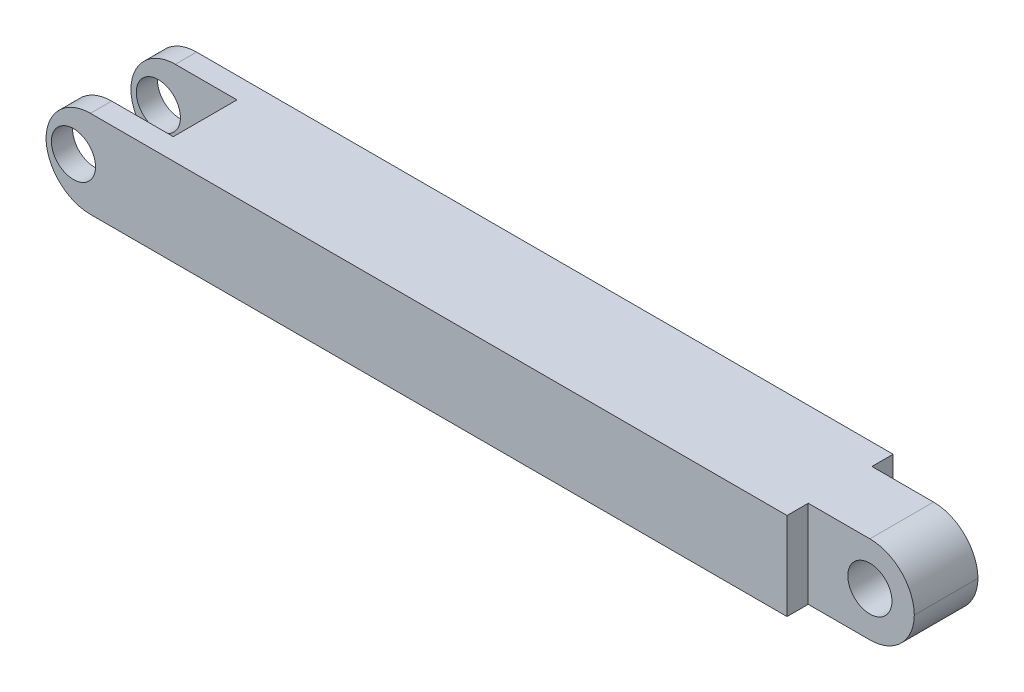
ISO-10303-21;
HEADER;
FILE_DESCRIPTION(('STEP AP214'),'2;1');
FILE_NAME('part.step','',(''),(''),'','','');
FILE_SCHEMA(('AUTOMOTIVE_DESIGN { 1 0 10303 214 1 1 1 1 }'));
ENDSEC;
DATA;
#1=APPLICATION_CONTEXT('core data for automotive mechanical design processes');
#2=APPLICATION_PROTOCOL_DEFINITION('international standard','automotive_design',2000,#1);
#3=PRODUCT_CONTEXT('',#1,'mechanical');
#4=PRODUCT('Part','Part','',(#3));
#5=PRODUCT_RELATED_PRODUCT_CATEGORY('part','',(#4));
#6=PRODUCT_DEFINITION_FORMATION('','',#4);
#7=PRODUCT_DEFINITION_CONTEXT('part definition',#1,'design');
#8=PRODUCT_DEFINITION('design','',#6,#7);
#9=PRODUCT_DEFINITION_SHAPE('','',#8);
#10=(LENGTH_UNIT() NAMED_UNIT(*) SI_UNIT(.MILLI.,.METRE.));
#11=(NAMED_UNIT(*) PLANE_ANGLE_UNIT() SI_UNIT($,.RADIAN.));
#12=(NAMED_UNIT(*) SI_UNIT($,.STERADIAN.) SOLID_ANGLE_UNIT());
#13=UNCERTAINTY_MEASURE_WITH_UNIT(LENGTH_MEASURE(1.E-05),#10,'distance_accuracy_value','');
#14=(GEOMETRIC_REPRESENTATION_CONTEXT(3) GLOBAL_UNCERTAINTY_ASSIGNED_CONTEXT((#13)) GLOBAL_UNIT_ASSIGNED_CONTEXT((#10,
#11,#12)) REPRESENTATION_CONTEXT('',''));
#15=CARTESIAN_POINT('',(0.,0.,0.));
#16=DIRECTION('',(0.,0.,1.));
#17=DIRECTION('',(1.,0.,0.));
#18=AXIS2_PLACEMENT_3D('',#15,#16,#17);
#19=CARTESIAN_POINT('',(69.85,8.255,0.));
#20=DIRECTION('',(1.,0.,0.));
#21=DIRECTION('',(0.,0.,-1.));
#22=AXIS2_PLACEMENT_3D('',#19,#20,#21);
#23=PLANE('',#22);
#24=DIRECTION('',(0.,0.,1.));
#25=VECTOR('',#24,1.);
#26=CARTESIAN_POINT('',(69.85,0.,0.));
#27=LINE('',#26,#25);
#28=CARTESIAN_POINT('',(69.85,0.,8.001));
#29=VERTEX_POINT('',#28);
#30=CARTESIAN_POINT('',(69.85,0.,9.99998));
#31=VERTEX_POINT('',#30);
#32=EDGE_CURVE('E159',#29,#31,#27,.T.);
#33=ORIENTED_EDGE('',*,*,#32,.F.);
#34=DIRECTION('',(0.,-1.,0.));
#35=VECTOR('',#34,1.);
#36=CARTESIAN_POINT('',(69.85,8.255,8.001));
#37=LINE('',#36,#35);
#38=CARTESIAN_POINT('',(69.85,8.255,8.001));
#39=VERTEX_POINT('',#38);
#40=EDGE_CURVE('E147',#39,#29,#37,.T.);
#41=ORIENTED_EDGE('',*,*,#40,.F.);
#42=DIRECTION('',(0.,0.,1.));
#43=VECTOR('',#42,1.);
#44=CARTESIAN_POINT('',(69.85,8.255,0.));
#45=LINE('',#44,#43);
#46=CARTESIAN_POINT('',(69.85,8.255,9.99998));
#47=VERTEX_POINT('',#46);
#48=EDGE_CURVE('E153',#39,#47,#45,.T.);
#49=ORIENTED_EDGE('',*,*,#48,.T.);
#50=DIRECTION('',(0.,-1.,0.));
#51=VECTOR('',#50,1.);
#52=CARTESIAN_POINT('',(69.85,8.255,9.99998));
#53=LINE('',#52,#51);
#54=EDGE_CURVE('E189',#47,#31,#53,.T.);
#55=ORIENTED_EDGE('',*,*,#54,.T.);
#56=EDGE_LOOP('',(#33,#41,#49,#55));
#57=FACE_BOUND('',#56,.T.);
#58=ADVANCED_FACE('F35',(#57),#23,.T.);
#59=CARTESIAN_POINT('',(0.,8.255,8.00100000000001));
#60=DIRECTION('',(0.,0.,1.));
#61=DIRECTION('',(1.,0.,0.));
#62=AXIS2_PLACEMENT_3D('',#59,#60,#61);
#63=PLANE('',#62);
#64=CARTESIAN_POINT('',(75.65898,4.191,8.00100000000001));
#65=DIRECTION('',(0.,0.,1.));
#66=DIRECTION('',(1.,0.,0.));
#67=AXIS2_PLACEMENT_3D('',#64,#65,#66);
#68=CIRCLE('',#67,2.07899);
#69=CARTESIAN_POINT('',(77.73797,4.191,8.00100000000001));
#70=VERTEX_POINT('',#69);
#71=EDGE_CURVE('E265',#70,#70,#68,.T.);
#72=ORIENTED_EDGE('',*,*,#71,.F.);
#73=EDGE_LOOP('',(#72));
#74=FACE_BOUND('',#73,.T.);
#75=DIRECTION('',(-1.,0.,0.));
#76=VECTOR('',#75,1.);
#77=CARTESIAN_POINT('',(0.,0.,8.00100000000001));
#78=LINE('',#77,#76);
#79=CARTESIAN_POINT('',(75.65898,0.,8.001));
#80=VERTEX_POINT('',#79);
#81=EDGE_CURVE('E191',#80,#29,#78,.T.);
#82=ORIENTED_EDGE('',*,*,#81,.F.);
#83=CARTESIAN_POINT('',(75.65898,4.191,8.001));
#84=DIRECTION('',(0.,0.,1.));
#85=DIRECTION('',(1.,0.,0.));
#86=AXIS2_PLACEMENT_3D('',#83,#84,#85);
#87=CIRCLE('',#86,4.191);
#88=CARTESIAN_POINT('',(79.8494989117817,4.1275,8.001));
#89=VERTEX_POINT('',#88);
#90=EDGE_CURVE('E253',#80,#89,#87,.T.);
#91=ORIENTED_EDGE('',*,*,#90,.T.);
#92=CARTESIAN_POINT('',(75.65898,4.064,8.001));
#93=DIRECTION('',(0.,0.,1.));
#94=DIRECTION('',(1.,0.,0.));
#95=AXIS2_PLACEMENT_3D('',#92,#93,#94);
#96=CIRCLE('',#95,4.191);
#97=CARTESIAN_POINT('',(75.65898,8.255,8.001));
#98=VERTEX_POINT('',#97);
#99=EDGE_CURVE('E150',#89,#98,#96,.T.);
#100=ORIENTED_EDGE('',*,*,#99,.T.);
#101=DIRECTION('',(-1.,0.,0.));
#102=VECTOR('',#101,1.);
#103=CARTESIAN_POINT('',(0.,8.255,8.00100000000001));
#104=LINE('',#103,#102);
#105=EDGE_CURVE('E143',#98,#39,#104,.T.);
#106=ORIENTED_EDGE('',*,*,#105,.T.);
#107=ORIENTED_EDGE('',*,*,#40,.T.);
#108=EDGE_LOOP('',(#82,#91,#100,#106,#107));
#109=FACE_BOUND('',#108,.T.);
#110=ADVANCED_FACE('F146',(#74,#109),#63,.T.);
#111=CARTESIAN_POINT('',(0.,8.255,1.99898000000001));
#112=DIRECTION('',(0.,0.,-1.));
#113=DIRECTION('',(-1.,0.,0.));
#114=AXIS2_PLACEMENT_3D('',#111,#112,#113);
#115=PLANE('',#114);
#116=CARTESIAN_POINT('',(75.65898,4.191,1.99898));
#117=DIRECTION('',(0.,0.,-1.));
#118=DIRECTION('',(-1.,0.,0.));
#119=AXIS2_PLACEMENT_3D('',#116,#117,#118);
#120=CIRCLE('',#119,2.07899);
#121=CARTESIAN_POINT('',(73.57999,4.191,1.99898));
#122=VERTEX_POINT('',#121);
#123=EDGE_CURVE('E39',#122,#122,#120,.T.);
#124=ORIENTED_EDGE('',*,*,#123,.F.);
#125=EDGE_LOOP('',(#124));
#126=FACE_BOUND('',#125,.T.);
#127=CARTESIAN_POINT('',(75.65898,4.064,1.99898));
#128=DIRECTION('',(0.,0.,-1.));
#129=DIRECTION('',(-1.,0.,0.));
#130=AXIS2_PLACEMENT_3D('',#127,#128,#129);
#131=CIRCLE('',#130,4.191);
#132=CARTESIAN_POINT('',(75.65898,8.255,1.99898));
#133=VERTEX_POINT('',#132);
#134=CARTESIAN_POINT('',(79.8494989117817,4.1275,1.99898));
#135=VERTEX_POINT('',#134);
#136=EDGE_CURVE('E52',#133,#135,#131,.T.);
#137=ORIENTED_EDGE('',*,*,#136,.T.);
#138=CARTESIAN_POINT('',(75.65898,4.191,1.99898));
#139=DIRECTION('',(0.,0.,-1.));
#140=DIRECTION('',(-1.,0.,0.));
#141=AXIS2_PLACEMENT_3D('',#138,#139,#140);
#142=CIRCLE('',#141,4.191);
#143=CARTESIAN_POINT('',(75.65898,0.,1.99898));
#144=VERTEX_POINT('',#143);
#145=EDGE_CURVE('E44',#135,#144,#142,.T.);
#146=ORIENTED_EDGE('',*,*,#145,.T.);
#147=DIRECTION('',(1.,0.,0.));
#148=VECTOR('',#147,1.);
#149=CARTESIAN_POINT('',(0.,0.,1.99898000000001));
#150=LINE('',#149,#148);
#151=CARTESIAN_POINT('',(69.85,0.,1.99898));
#152=VERTEX_POINT('',#151);
#153=EDGE_CURVE('E194',#152,#144,#150,.T.);
#154=ORIENTED_EDGE('',*,*,#153,.F.);
#155=DIRECTION('',(0.,-1.,0.));
#156=VECTOR('',#155,1.);
#157=CARTESIAN_POINT('',(69.85,8.255,1.99898));
#158=LINE('',#157,#156);
#159=CARTESIAN_POINT('',(69.85,8.255,1.99898));
#160=VERTEX_POINT('',#159);
#161=EDGE_CURVE('E161',#160,#152,#158,.T.);
#162=ORIENTED_EDGE('',*,*,#161,.F.);
#163=DIRECTION('',(1.,0.,0.));
#164=VECTOR('',#163,1.);
#165=CARTESIAN_POINT('',(0.,8.255,1.99898000000001));
#166=LINE('',#165,#164);
#167=EDGE_CURVE('E152',#160,#133,#166,.T.);
#168=ORIENTED_EDGE('',*,*,#167,.T.);
#169=EDGE_LOOP('',(#137,#146,#154,#162,#168));
#170=FACE_BOUND('',#169,.T.);
#171=ADVANCED_FACE('F304',(#126,#170),#115,.T.);
#172=CARTESIAN_POINT('',(69.85,8.255,0.));
#173=DIRECTION('',(1.,0.,0.));
#174=DIRECTION('',(0.,0.,-1.));
#175=AXIS2_PLACEMENT_3D('',#172,#173,#174);
#176=PLANE('',#175);
#177=DIRECTION('',(0.,0.,1.));
#178=VECTOR('',#177,1.);
#179=CARTESIAN_POINT('',(69.85,0.,0.));
#180=LINE('',#179,#178);
#181=CARTESIAN_POINT('',(69.85,0.,0.));
#182=VERTEX_POINT('',#181);
#183=EDGE_CURVE('E197',#182,#152,#180,.T.);
#184=ORIENTED_EDGE('',*,*,#183,.F.);
#185=DIRECTION('',(0.,-1.,0.));
#186=VECTOR('',#185,1.);
#187=CARTESIAN_POINT('',(69.85,8.255,0.));
#188=LINE('',#187,#186);
#189=CARTESIAN_POINT('',(69.85,8.255,0.));
#190=VERTEX_POINT('',#189);
#191=EDGE_CURVE('E215',#190,#182,#188,.T.);
#192=ORIENTED_EDGE('',*,*,#191,.F.);
#193=DIRECTION('',(0.,0.,1.));
#194=VECTOR('',#193,1.);
#195=CARTESIAN_POINT('',(69.85,8.255,0.));
#196=LINE('',#195,#194);
#197=EDGE_CURVE('E176',#190,#160,#196,.T.);
#198=ORIENTED_EDGE('',*,*,#197,.T.);
#199=ORIENTED_EDGE('',*,*,#161,.T.);
#200=EDGE_LOOP('',(#184,#192,#198,#199));
#201=FACE_BOUND('',#200,.T.);
#202=ADVANCED_FACE('F336',(#201),#176,.T.);
#203=CARTESIAN_POINT('',(0.,8.255,0.));
#204=DIRECTION('',(0.,0.,-1.));
#205=DIRECTION('',(-1.,0.,0.));
#206=AXIS2_PLACEMENT_3D('',#203,#204,#205);
#207=PLANE('',#206);
#208=CARTESIAN_POINT('',(2.58747108821831,4.1275,0.));
#209=DIRECTION('',(0.,0.,1.));
#210=DIRECTION('',(1.,0.,0.));
#211=AXIS2_PLACEMENT_3D('',#208,#209,#210);
#212=CIRCLE('',#211,2.07899);
#213=CARTESIAN_POINT('',(4.66646108821831,4.1275,0.));
#214=VERTEX_POINT('',#213);
#215=EDGE_CURVE('E262',#214,#214,#212,.T.);
#216=ORIENTED_EDGE('',*,*,#215,.T.);
#217=EDGE_LOOP('',(#216));
#218=FACE_BOUND('',#217,.T.);
#219=DIRECTION('',(1.,0.,0.));
#220=VECTOR('',#219,1.);
#221=CARTESIAN_POINT('',(0.,0.,0.));
#222=LINE('',#221,#220);
#223=CARTESIAN_POINT('',(4.191,0.,0.));
#224=VERTEX_POINT('',#223);
#225=EDGE_CURVE('E200',#224,#182,#222,.T.);
#226=ORIENTED_EDGE('',*,*,#225,.F.);
#227=CARTESIAN_POINT('',(4.191,4.191,0.));
#228=DIRECTION('',(0.,0.,-1.));
#229=DIRECTION('',(-1.,0.,0.));
#230=AXIS2_PLACEMENT_3D('',#227,#228,#229);
#231=CIRCLE('',#230,4.191);
#232=CARTESIAN_POINT('',(0.000481088218309486,4.1275,0.));
#233=VERTEX_POINT('',#232);
#234=EDGE_CURVE('E230',#224,#233,#231,.T.);
#235=ORIENTED_EDGE('',*,*,#234,.T.);
#236=CARTESIAN_POINT('',(4.191,4.064,0.));
#237=DIRECTION('',(0.,0.,-1.));
#238=DIRECTION('',(-1.,0.,0.));
#239=AXIS2_PLACEMENT_3D('',#236,#237,#238);
#240=CIRCLE('',#239,4.191);
#241=CARTESIAN_POINT('',(4.191,8.255,0.));
#242=VERTEX_POINT('',#241);
#243=EDGE_CURVE('E228',#233,#242,#240,.T.);
#244=ORIENTED_EDGE('',*,*,#243,.T.);
#245=DIRECTION('',(1.,0.,0.));
#246=VECTOR('',#245,1.);
#247=CARTESIAN_POINT('',(0.,8.255,0.));
#248=LINE('',#247,#246);
#249=EDGE_CURVE('E179',#242,#190,#248,.T.);
#250=ORIENTED_EDGE('',*,*,#249,.T.);
#251=ORIENTED_EDGE('',*,*,#191,.T.);
#252=EDGE_LOOP('',(#226,#235,#244,#250,#251));
#253=FACE_BOUND('',#252,.T.);
#254=ADVANCED_FACE('F367',(#218,#253),#207,.T.);
#255=CARTESIAN_POINT('',(0.,8.255,1.99898));
#256=DIRECTION('',(0.,0.,-1.));
#257=DIRECTION('',(-1.,0.,0.));
#258=AXIS2_PLACEMENT_3D('',#255,#256,#257);
#259=PLANE('',#258);
#260=CARTESIAN_POINT('',(2.58747108821831,4.1275,1.99898));
#261=DIRECTION('',(0.,0.,-1.));
#262=DIRECTION('',(-1.,0.,0.));
#263=AXIS2_PLACEMENT_3D('',#260,#261,#262);
#264=CIRCLE('',#263,2.07899);
#265=CARTESIAN_POINT('',(0.508481088218311,4.1275,1.99898));
#266=VERTEX_POINT('',#265);
#267=EDGE_CURVE('E172',#266,#266,#264,.T.);
#268=ORIENTED_EDGE('',*,*,#267,.T.);
#269=EDGE_LOOP('',(#268));
#270=FACE_BOUND('',#269,.T.);
#271=CARTESIAN_POINT('',(4.191,4.064,1.99898));
#272=DIRECTION('',(0.,0.,-1.));
#273=DIRECTION('',(-1.,0.,0.));
#274=AXIS2_PLACEMENT_3D('',#271,#272,#273);
#275=CIRCLE('',#274,4.191);
#276=CARTESIAN_POINT('',(4.191,8.255,1.99898));
#277=VERTEX_POINT('',#276);
#278=CARTESIAN_POINT('',(0.000481088218309486,4.1275,1.99898));
#279=VERTEX_POINT('',#278);
#280=EDGE_CURVE('E160',#277,#279,#275,.F.);
#281=ORIENTED_EDGE('',*,*,#280,.T.);
#282=CARTESIAN_POINT('',(4.191,4.191,1.99898));
#283=DIRECTION('',(0.,0.,-1.));
#284=DIRECTION('',(-1.,0.,0.));
#285=AXIS2_PLACEMENT_3D('',#282,#283,#284);
#286=CIRCLE('',#285,4.191);
#287=CARTESIAN_POINT('',(4.191,0.,1.99898));
#288=VERTEX_POINT('',#287);
#289=EDGE_CURVE('E220',#279,#288,#286,.F.);
#290=ORIENTED_EDGE('',*,*,#289,.T.);
#291=DIRECTION('',(1.,0.,0.));
#292=VECTOR('',#291,1.);
#293=CARTESIAN_POINT('',(0.,0.,1.99898));
#294=LINE('',#293,#292);
#295=CARTESIAN_POINT('',(9.99998,0.,1.99898));
#296=VERTEX_POINT('',#295);
#297=EDGE_CURVE('E202',#288,#296,#294,.T.);
#298=ORIENTED_EDGE('',*,*,#297,.T.);
#299=DIRECTION('',(0.,-1.,0.));
#300=VECTOR('',#299,1.);
#301=CARTESIAN_POINT('',(9.99998,8.255,1.99898));
#302=LINE('',#301,#300);
#303=CARTESIAN_POINT('',(9.99998,8.255,1.99898));
#304=VERTEX_POINT('',#303);
#305=EDGE_CURVE('E212',#304,#296,#302,.T.);
#306=ORIENTED_EDGE('',*,*,#305,.F.);
#307=DIRECTION('',(1.,0.,0.));
#308=VECTOR('',#307,1.);
#309=CARTESIAN_POINT('',(0.,8.255,1.99898));
#310=LINE('',#309,#308);
#311=EDGE_CURVE('E181',#277,#304,#310,.T.);
#312=ORIENTED_EDGE('',*,*,#311,.F.);
#313=EDGE_LOOP('',(#281,#290,#298,#306,#312));
#314=FACE_BOUND('',#313,.T.);
#315=ADVANCED_FACE('F281',(#270,#314),#259,.F.);
#316=CARTESIAN_POINT('',(9.99998,8.255,0.));
#317=DIRECTION('',(-1.,0.,0.));
#318=DIRECTION('',(0.,0.,1.));
#319=AXIS2_PLACEMENT_3D('',#316,#317,#318);
#320=PLANE('',#319);
#321=DIRECTION('',(0.,0.,-1.));
#322=VECTOR('',#321,1.);
#323=CARTESIAN_POINT('',(9.99998,0.,0.));
#324=LINE('',#323,#322);
#325=CARTESIAN_POINT('',(9.99998,0.,8.001));
#326=VERTEX_POINT('',#325);
#327=EDGE_CURVE('E204',#326,#296,#324,.T.);
#328=ORIENTED_EDGE('',*,*,#327,.F.);
#329=DIRECTION('',(0.,-1.,0.));
#330=VECTOR('',#329,1.);
#331=CARTESIAN_POINT('',(9.99998,8.255,8.001));
#332=LINE('',#331,#330);
#333=CARTESIAN_POINT('',(9.99998,8.255,8.001));
#334=VERTEX_POINT('',#333);
#335=EDGE_CURVE('E209',#334,#326,#332,.T.);
#336=ORIENTED_EDGE('',*,*,#335,.F.);
#337=DIRECTION('',(0.,0.,-1.));
#338=VECTOR('',#337,1.);
#339=CARTESIAN_POINT('',(9.99998,8.255,0.));
#340=LINE('',#339,#338);
#341=EDGE_CURVE('E183',#334,#304,#340,.T.);
#342=ORIENTED_EDGE('',*,*,#341,.T.);
#343=ORIENTED_EDGE('',*,*,#305,.T.);
#344=EDGE_LOOP('',(#328,#336,#342,#343));
#345=FACE_BOUND('',#344,.T.);
#346=ADVANCED_FACE('F354',(#345),#320,.T.);
#347=CARTESIAN_POINT('',(0.,8.255,8.001));
#348=DIRECTION('',(0.,0.,-1.));
#349=DIRECTION('',(-1.,0.,0.));
#350=AXIS2_PLACEMENT_3D('',#347,#348,#349);
#351=PLANE('',#350);
#352=CARTESIAN_POINT('',(2.58747108821831,4.1275,8.001));
#353=DIRECTION('',(0.,0.,-1.));
#354=DIRECTION('',(-1.,0.,0.));
#355=AXIS2_PLACEMENT_3D('',#352,#353,#354);
#356=CIRCLE('',#355,2.07899);
#357=CARTESIAN_POINT('',(0.508481088218311,4.1275,8.001));
#358=VERTEX_POINT('',#357);
#359=EDGE_CURVE('E274',#358,#358,#356,.T.);
#360=ORIENTED_EDGE('',*,*,#359,.F.);
#361=EDGE_LOOP('',(#360));
#362=FACE_BOUND('',#361,.T.);
#363=DIRECTION('',(1.,0.,0.));
#364=VECTOR('',#363,1.);
#365=CARTESIAN_POINT('',(0.,0.,8.001));
#366=LINE('',#365,#364);
#367=CARTESIAN_POINT('',(4.191,0.,8.001));
#368=VERTEX_POINT('',#367);
#369=EDGE_CURVE('E169',#368,#326,#366,.T.);
#370=ORIENTED_EDGE('',*,*,#369,.F.);
#371=CARTESIAN_POINT('',(4.191,4.191,8.001));
#372=DIRECTION('',(0.,0.,-1.));
#373=DIRECTION('',(-1.,0.,0.));
#374=AXIS2_PLACEMENT_3D('',#371,#372,#373);
#375=CIRCLE('',#374,4.191);
#376=CARTESIAN_POINT('',(0.000481088218310353,4.1275,8.001));
#377=VERTEX_POINT('',#376);
#378=EDGE_CURVE('E234',#368,#377,#375,.T.);
#379=ORIENTED_EDGE('',*,*,#378,.T.);
#380=CARTESIAN_POINT('',(4.191,4.064,8.001));
#381=DIRECTION('',(0.,0.,-1.));
#382=DIRECTION('',(-1.,0.,0.));
#383=AXIS2_PLACEMENT_3D('',#380,#381,#382);
#384=CIRCLE('',#383,4.191);
#385=CARTESIAN_POINT('',(4.191,8.255,8.001));
#386=VERTEX_POINT('',#385);
#387=EDGE_CURVE('E232',#377,#386,#384,.T.);
#388=ORIENTED_EDGE('',*,*,#387,.T.);
#389=DIRECTION('',(1.,0.,0.));
#390=VECTOR('',#389,1.);
#391=CARTESIAN_POINT('',(0.,8.255,8.001));
#392=LINE('',#391,#390);
#393=EDGE_CURVE('E186',#386,#334,#392,.T.);
#394=ORIENTED_EDGE('',*,*,#393,.T.);
#395=ORIENTED_EDGE('',*,*,#335,.T.);
#396=EDGE_LOOP('',(#370,#379,#388,#394,#395));
#397=FACE_BOUND('',#396,.T.);
#398=ADVANCED_FACE('F357',(#362,#397),#351,.T.);
#399=CARTESIAN_POINT('',(0.,8.255,9.99998));
#400=DIRECTION('',(0.,0.,-1.));
#401=DIRECTION('',(-1.,0.,0.));
#402=AXIS2_PLACEMENT_3D('',#399,#400,#401);
#403=PLANE('',#402);
#404=CARTESIAN_POINT('',(2.58747108821831,4.1275,9.99998));
#405=DIRECTION('',(0.,0.,1.));
#406=DIRECTION('',(1.,0.,0.));
#407=AXIS2_PLACEMENT_3D('',#404,#405,#406);
#408=CIRCLE('',#407,2.07899);
#409=CARTESIAN_POINT('',(4.66646108821831,4.1275,9.99998));
#410=VERTEX_POINT('',#409);
#411=EDGE_CURVE('E258',#410,#410,#408,.T.);
#412=ORIENTED_EDGE('',*,*,#411,.F.);
#413=EDGE_LOOP('',(#412));
#414=FACE_BOUND('',#413,.T.);
#415=CARTESIAN_POINT('',(4.191,4.064,9.99998));
#416=DIRECTION('',(0.,0.,-1.));
#417=DIRECTION('',(-1.,0.,0.));
#418=AXIS2_PLACEMENT_3D('',#415,#416,#417);
#419=CIRCLE('',#418,4.191);
#420=CARTESIAN_POINT('',(4.191,8.255,9.99998));
#421=VERTEX_POINT('',#420);
#422=CARTESIAN_POINT('',(0.000481088218311221,4.1275,9.99998));
#423=VERTEX_POINT('',#422);
#424=EDGE_CURVE('E236',#421,#423,#419,.F.);
#425=ORIENTED_EDGE('',*,*,#424,.T.);
#426=CARTESIAN_POINT('',(4.191,4.191,9.99998));
#427=DIRECTION('',(0.,0.,-1.));
#428=DIRECTION('',(-1.,0.,0.));
#429=AXIS2_PLACEMENT_3D('',#426,#427,#428);
#430=CIRCLE('',#429,4.191);
#431=CARTESIAN_POINT('',(4.191,0.,9.99998));
#432=VERTEX_POINT('',#431);
#433=EDGE_CURVE('E238',#423,#432,#430,.F.);
#434=ORIENTED_EDGE('',*,*,#433,.T.);
#435=DIRECTION('',(1.,0.,0.));
#436=VECTOR('',#435,1.);
#437=CARTESIAN_POINT('',(0.,0.,9.99998));
#438=LINE('',#437,#436);
#439=EDGE_CURVE('E167',#432,#31,#438,.T.);
#440=ORIENTED_EDGE('',*,*,#439,.T.);
#441=ORIENTED_EDGE('',*,*,#54,.F.);
#442=DIRECTION('',(1.,0.,0.));
#443=VECTOR('',#442,1.);
#444=CARTESIAN_POINT('',(0.,8.255,9.99998));
#445=LINE('',#444,#443);
#446=EDGE_CURVE('E165',#421,#47,#445,.T.);
#447=ORIENTED_EDGE('',*,*,#446,.F.);
#448=EDGE_LOOP('',(#425,#434,#440,#441,#447));
#449=FACE_BOUND('',#448,.T.);
#450=ADVANCED_FACE('F365',(#414,#449),#403,.F.);
#451=CARTESIAN_POINT('',(0.,8.255,0.));
#452=DIRECTION('',(0.,1.,0.));
#453=DIRECTION('',(0.,0.,1.));
#454=AXIS2_PLACEMENT_3D('',#451,#452,#453);
#455=PLANE('',#454);
#456=ORIENTED_EDGE('',*,*,#105,.F.);
#457=DIRECTION('',(0.,0.,1.));
#458=VECTOR('',#457,1.);
#459=CARTESIAN_POINT('',(75.65898,8.255,0.));
#460=LINE('',#459,#458);
#461=EDGE_CURVE('E11',#98,#133,#460,.F.);
#462=ORIENTED_EDGE('',*,*,#461,.T.);
#463=ORIENTED_EDGE('',*,*,#167,.F.);
#464=ORIENTED_EDGE('',*,*,#197,.F.);
#465=ORIENTED_EDGE('',*,*,#249,.F.);
#466=DIRECTION('',(0.,0.,1.));
#467=VECTOR('',#466,1.);
#468=CARTESIAN_POINT('',(4.191,8.255,1.99898));
#469=LINE('',#468,#467);
#470=EDGE_CURVE('E242',#242,#277,#469,.T.);
#471=ORIENTED_EDGE('',*,*,#470,.T.);
#472=ORIENTED_EDGE('',*,*,#311,.T.);
#473=ORIENTED_EDGE('',*,*,#341,.F.);
#474=ORIENTED_EDGE('',*,*,#393,.F.);
#475=DIRECTION('',(0.,0.,-1.));
#476=VECTOR('',#475,1.);
#477=CARTESIAN_POINT('',(4.191,8.255,0.));
#478=LINE('',#477,#476);
#479=EDGE_CURVE('E240',#386,#421,#478,.F.);
#480=ORIENTED_EDGE('',*,*,#479,.T.);
#481=ORIENTED_EDGE('',*,*,#446,.T.);
#482=ORIENTED_EDGE('',*,*,#48,.F.);
#483=EDGE_LOOP('',(#456,#462,#463,#464,#465,#471,#472,#473,#474,#480,#481,#482));
#484=FACE_BOUND('',#483,.T.);
#485=ADVANCED_FACE('F163',(#484),#455,.T.);
#486=CARTESIAN_POINT('',(0.,0.,0.));
#487=DIRECTION('',(0.,1.,0.));
#488=DIRECTION('',(0.,0.,1.));
#489=AXIS2_PLACEMENT_3D('',#486,#487,#488);
#490=PLANE('',#489);
#491=ORIENTED_EDGE('',*,*,#153,.T.);
#492=DIRECTION('',(0.,0.,1.));
#493=VECTOR('',#492,1.);
#494=CARTESIAN_POINT('',(75.65898,0.,8.001));
#495=LINE('',#494,#493);
#496=EDGE_CURVE('E244',#144,#80,#495,.T.);
#497=ORIENTED_EDGE('',*,*,#496,.T.);
#498=ORIENTED_EDGE('',*,*,#81,.T.);
#499=ORIENTED_EDGE('',*,*,#32,.T.);
#500=ORIENTED_EDGE('',*,*,#439,.F.);
#501=DIRECTION('',(0.,0.,-1.));
#502=VECTOR('',#501,1.);
#503=CARTESIAN_POINT('',(4.191,0.,8.001));
#504=LINE('',#503,#502);
#505=EDGE_CURVE('E222',#432,#368,#504,.T.);
#506=ORIENTED_EDGE('',*,*,#505,.T.);
#507=ORIENTED_EDGE('',*,*,#369,.T.);
#508=ORIENTED_EDGE('',*,*,#327,.T.);
#509=ORIENTED_EDGE('',*,*,#297,.F.);
#510=DIRECTION('',(0.,0.,1.));
#511=VECTOR('',#510,1.);
#512=CARTESIAN_POINT('',(4.191,0.,0.));
#513=LINE('',#512,#511);
#514=EDGE_CURVE('E225',#288,#224,#513,.F.);
#515=ORIENTED_EDGE('',*,*,#514,.T.);
#516=ORIENTED_EDGE('',*,*,#225,.T.);
#517=ORIENTED_EDGE('',*,*,#183,.T.);
#518=EDGE_LOOP('',(#491,#497,#498,#499,#500,#506,#507,#508,#509,#515,#516,#517));
#519=FACE_BOUND('',#518,.T.);
#520=ADVANCED_FACE('F317',(#519),#490,.F.);
#521=CARTESIAN_POINT('',(4.191,4.064,0.));
#522=DIRECTION('',(0.,0.,-1.));
#523=DIRECTION('',(-1.,0.,0.));
#524=AXIS2_PLACEMENT_3D('',#521,#522,#523);
#525=CYLINDRICAL_SURFACE('',#524,4.191);
#526=ORIENTED_EDGE('',*,*,#470,.F.);
#527=ORIENTED_EDGE('',*,*,#243,.F.);
#528=DIRECTION('',(0.,0.,-1.));
#529=VECTOR('',#528,1.);
#530=CARTESIAN_POINT('',(0.000481088218309486,4.1275,0.99949));
#531=LINE('',#530,#529);
#532=EDGE_CURVE('E192',#279,#233,#531,.T.);
#533=ORIENTED_EDGE('',*,*,#532,.F.);
#534=ORIENTED_EDGE('',*,*,#280,.F.);
#535=EDGE_LOOP('',(#526,#527,#533,#534));
#536=FACE_BOUND('',#535,.T.);
#537=ADVANCED_FACE('F313',(#536),#525,.T.);
#538=CARTESIAN_POINT('',(4.191,4.191,0.));
#539=DIRECTION('',(0.,0.,1.));
#540=DIRECTION('',(1.,0.,0.));
#541=AXIS2_PLACEMENT_3D('',#538,#539,#540);
#542=CYLINDRICAL_SURFACE('',#541,4.191);
#543=ORIENTED_EDGE('',*,*,#234,.F.);
#544=ORIENTED_EDGE('',*,*,#514,.F.);
#545=ORIENTED_EDGE('',*,*,#289,.F.);
#546=ORIENTED_EDGE('',*,*,#532,.T.);
#547=EDGE_LOOP('',(#543,#544,#545,#546));
#548=FACE_BOUND('',#547,.T.);
#549=ADVANCED_FACE('F309',(#548),#542,.T.);
#550=CARTESIAN_POINT('',(4.191,4.064,0.));
#551=DIRECTION('',(0.,0.,-1.));
#552=DIRECTION('',(-1.,0.,0.));
#553=AXIS2_PLACEMENT_3D('',#550,#551,#552);
#554=CYLINDRICAL_SURFACE('',#553,4.191);
#555=DIRECTION('',(0.,0.,-1.));
#556=VECTOR('',#555,1.);
#557=CARTESIAN_POINT('',(0.000481088218311221,4.1275,9.00049));
#558=LINE('',#557,#556);
#559=EDGE_CURVE('E247',#423,#377,#558,.T.);
#560=ORIENTED_EDGE('',*,*,#559,.F.);
#561=ORIENTED_EDGE('',*,*,#424,.F.);
#562=ORIENTED_EDGE('',*,*,#479,.F.);
#563=ORIENTED_EDGE('',*,*,#387,.F.);
#564=EDGE_LOOP('',(#560,#561,#562,#563));
#565=FACE_BOUND('',#564,.T.);
#566=ADVANCED_FACE('F312',(#565),#554,.T.);
#567=CARTESIAN_POINT('',(4.191,4.191,0.));
#568=DIRECTION('',(0.,0.,1.));
#569=DIRECTION('',(1.,0.,0.));
#570=AXIS2_PLACEMENT_3D('',#567,#568,#569);
#571=CYLINDRICAL_SURFACE('',#570,4.191);
#572=ORIENTED_EDGE('',*,*,#433,.F.);
#573=ORIENTED_EDGE('',*,*,#559,.T.);
#574=ORIENTED_EDGE('',*,*,#378,.F.);
#575=ORIENTED_EDGE('',*,*,#505,.F.);
#576=EDGE_LOOP('',(#572,#573,#574,#575));
#577=FACE_BOUND('',#576,.T.);
#578=ADVANCED_FACE('F295',(#577),#571,.T.);
#579=CARTESIAN_POINT('',(2.58747108821831,4.1275,0.));
#580=DIRECTION('',(0.,0.,1.));
#581=DIRECTION('',(1.,0.,0.));
#582=AXIS2_PLACEMENT_3D('',#579,#580,#581);
#583=CYLINDRICAL_SURFACE('',#582,2.07899);
#584=ORIENTED_EDGE('',*,*,#359,.T.);
#585=EDGE_LOOP('',(#584));
#586=FACE_BOUND('',#585,.T.);
#587=ORIENTED_EDGE('',*,*,#411,.T.);
#588=EDGE_LOOP('',(#587));
#589=FACE_BOUND('',#588,.T.);
#590=ADVANCED_FACE('F286',(#586,#589),#583,.F.);
#591=ORIENTED_EDGE('',*,*,#215,.F.);
#592=EDGE_LOOP('',(#591));
#593=FACE_BOUND('',#592,.T.);
#594=ORIENTED_EDGE('',*,*,#267,.F.);
#595=EDGE_LOOP('',(#594));
#596=FACE_BOUND('',#595,.T.);
#597=ADVANCED_FACE('F284',(#593,#596),#583,.F.);
#598=CARTESIAN_POINT('',(75.65898,4.064,0.));
#599=DIRECTION('',(0.,0.,1.));
#600=DIRECTION('',(1.,0.,0.));
#601=AXIS2_PLACEMENT_3D('',#598,#599,#600);
#602=CYLINDRICAL_SURFACE('',#601,4.191);
#603=DIRECTION('',(0.,0.,1.));
#604=VECTOR('',#603,1.);
#605=CARTESIAN_POINT('',(79.8494989117817,4.1275,4.99999));
#606=LINE('',#605,#604);
#607=EDGE_CURVE('E256',#135,#89,#606,.T.);
#608=ORIENTED_EDGE('',*,*,#607,.F.);
#609=ORIENTED_EDGE('',*,*,#136,.F.);
#610=ORIENTED_EDGE('',*,*,#461,.F.);
#611=ORIENTED_EDGE('',*,*,#99,.F.);
#612=EDGE_LOOP('',(#608,#609,#610,#611));
#613=FACE_BOUND('',#612,.T.);
#614=ADVANCED_FACE('F37',(#613),#602,.T.);
#615=CARTESIAN_POINT('',(75.65898,4.191,0.));
#616=DIRECTION('',(0.,0.,-1.));
#617=DIRECTION('',(-1.,0.,0.));
#618=AXIS2_PLACEMENT_3D('',#615,#616,#617);
#619=CYLINDRICAL_SURFACE('',#618,4.191);
#620=ORIENTED_EDGE('',*,*,#145,.F.);
#621=ORIENTED_EDGE('',*,*,#607,.T.);
#622=ORIENTED_EDGE('',*,*,#90,.F.);
#623=ORIENTED_EDGE('',*,*,#496,.F.);
#624=EDGE_LOOP('',(#620,#621,#622,#623));
#625=FACE_BOUND('',#624,.T.);
#626=ADVANCED_FACE('F293',(#625),#619,.T.);
#627=CARTESIAN_POINT('',(75.65898,4.191,-0.253999999999987));
#628=DIRECTION('',(0.,0.,1.));
#629=DIRECTION('',(1.,0.,0.));
#630=AXIS2_PLACEMENT_3D('',#627,#628,#629);
#631=CYLINDRICAL_SURFACE('',#630,2.07899);
#632=ORIENTED_EDGE('',*,*,#123,.T.);
#633=EDGE_LOOP('',(#632));
#634=FACE_BOUND('',#633,.T.);
#635=ORIENTED_EDGE('',*,*,#71,.T.);
#636=EDGE_LOOP('',(#635));
#637=FACE_BOUND('',#636,.T.);
#638=ADVANCED_FACE('F325',(#634,#637),#631,.F.);
#639=CLOSED_SHELL('',(#58,#110,#171,#202,#254,#315,#346,#398,#450,#485,#520,#537,#549,#566,#578,
#590,#597,#614,#626,#638));
#640=MANIFOLD_SOLID_BREP('B2',#639);
#641=ADVANCED_BREP_SHAPE_REPRESENTATION('',(#18,#640),#14);
#642=SHAPE_DEFINITION_REPRESENTATION(#9,#641);
ENDSEC;
END-ISO-10303-21;
